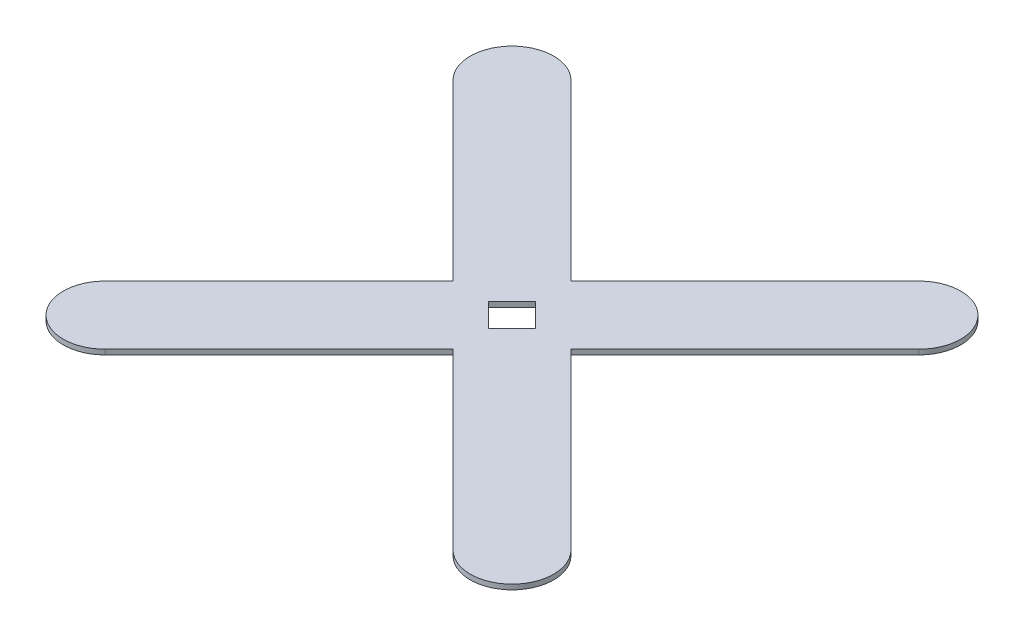
ISO-10303-21;
HEADER;
FILE_DESCRIPTION(('STEP AP214'),'2;1');
FILE_NAME('part.step','',(''),(''),'','','');
FILE_SCHEMA(('AUTOMOTIVE_DESIGN { 1 0 10303 214 1 1 1 1 }'));
ENDSEC;
DATA;
#1=APPLICATION_CONTEXT('core data for automotive mechanical design processes');
#2=APPLICATION_PROTOCOL_DEFINITION('international standard','automotive_design',2000,#1);
#3=PRODUCT_CONTEXT('',#1,'mechanical');
#4=PRODUCT('Part','Part','',(#3));
#5=PRODUCT_RELATED_PRODUCT_CATEGORY('part','',(#4));
#6=PRODUCT_DEFINITION_FORMATION('','',#4);
#7=PRODUCT_DEFINITION_CONTEXT('part definition',#1,'design');
#8=PRODUCT_DEFINITION('design','',#6,#7);
#9=PRODUCT_DEFINITION_SHAPE('','',#8);
#10=(LENGTH_UNIT() NAMED_UNIT(*) SI_UNIT(.MILLI.,.METRE.));
#11=(NAMED_UNIT(*) PLANE_ANGLE_UNIT() SI_UNIT($,.RADIAN.));
#12=(NAMED_UNIT(*) SI_UNIT($,.STERADIAN.) SOLID_ANGLE_UNIT());
#13=UNCERTAINTY_MEASURE_WITH_UNIT(LENGTH_MEASURE(1.E-05),#10,'distance_accuracy_value','');
#14=(GEOMETRIC_REPRESENTATION_CONTEXT(3) GLOBAL_UNCERTAINTY_ASSIGNED_CONTEXT((#13)) GLOBAL_UNIT_ASSIGNED_CONTEXT((#10,
#11,#12)) REPRESENTATION_CONTEXT('',''));
#15=CARTESIAN_POINT('',(0.,0.,0.));
#16=DIRECTION('',(0.,0.,1.));
#17=DIRECTION('',(1.,0.,0.));
#18=AXIS2_PLACEMENT_3D('',#15,#16,#17);
#19=CARTESIAN_POINT('',(122.,3.,122.));
#20=DIRECTION('',(0.,-1.,0.));
#21=DIRECTION('',(0.,0.,-1.));
#22=AXIS2_PLACEMENT_3D('',#19,#20,#21);
#23=CYLINDRICAL_SURFACE('',#22,25.);
#24=CARTESIAN_POINT('',(122.,0.,122.));
#25=DIRECTION('',(0.,1.,0.));
#26=DIRECTION('',(0.,0.,1.));
#27=AXIS2_PLACEMENT_3D('',#24,#25,#26);
#28=CIRCLE('',#27,25.);
#29=CARTESIAN_POINT('',(104.322330470336,0.,139.677669529664));
#30=VERTEX_POINT('',#29);
#31=CARTESIAN_POINT('',(139.677669529664,0.,104.322330470336));
#32=VERTEX_POINT('',#31);
#33=EDGE_CURVE('E171',#30,#32,#28,.T.);
#34=ORIENTED_EDGE('',*,*,#33,.T.);
#35=DIRECTION('',(0.,-1.,0.));
#36=VECTOR('',#35,1.);
#37=CARTESIAN_POINT('',(139.677669529664,3.,104.322330470336));
#38=LINE('',#37,#36);
#39=CARTESIAN_POINT('',(139.677669529664,3.,104.322330470336));
#40=VERTEX_POINT('',#39);
#41=EDGE_CURVE('E256',#40,#32,#38,.T.);
#42=ORIENTED_EDGE('',*,*,#41,.F.);
#43=CARTESIAN_POINT('',(122.,3.,122.));
#44=DIRECTION('',(0.,1.,0.));
#45=DIRECTION('',(0.,0.,1.));
#46=AXIS2_PLACEMENT_3D('',#43,#44,#45);
#47=CIRCLE('',#46,25.);
#48=CARTESIAN_POINT('',(104.322330470336,3.,139.677669529664));
#49=VERTEX_POINT('',#48);
#50=EDGE_CURVE('E174',#49,#40,#47,.T.);
#51=ORIENTED_EDGE('',*,*,#50,.F.);
#52=DIRECTION('',(0.,-1.,0.));
#53=VECTOR('',#52,1.);
#54=CARTESIAN_POINT('',(104.322330470336,3.,139.677669529664));
#55=LINE('',#54,#53);
#56=EDGE_CURVE('E200',#49,#30,#55,.T.);
#57=ORIENTED_EDGE('',*,*,#56,.T.);
#58=EDGE_LOOP('',(#34,#42,#51,#57));
#59=FACE_BOUND('',#58,.T.);
#60=ADVANCED_FACE('F33',(#59),#23,.T.);
#61=CARTESIAN_POINT('',(139.677669529664,3.,104.322330470336));
#62=DIRECTION('',(-0.707106781186548,0.,0.707106781186547));
#63=DIRECTION('',(0.707106781186547,0.,0.707106781186548));
#64=AXIS2_PLACEMENT_3D('',#61,#62,#63);
#65=PLANE('',#64);
#66=DIRECTION('',(-0.707106781186547,0.,-0.707106781186548));
#67=VECTOR('',#66,1.);
#68=CARTESIAN_POINT('',(139.677669529664,0.,104.322330470336));
#69=LINE('',#68,#67);
#70=CARTESIAN_POINT('',(35.3553390593272,0.,0.));
#71=VERTEX_POINT('',#70);
#72=EDGE_CURVE('E203',#32,#71,#69,.T.);
#73=ORIENTED_EDGE('',*,*,#72,.T.);
#74=DIRECTION('',(0.,-1.,0.));
#75=VECTOR('',#74,1.);
#76=CARTESIAN_POINT('',(35.3553390593272,3.,0.));
#77=LINE('',#76,#75);
#78=CARTESIAN_POINT('',(35.3553390593272,3.,0.));
#79=VERTEX_POINT('',#78);
#80=EDGE_CURVE('E253',#79,#71,#77,.T.);
#81=ORIENTED_EDGE('',*,*,#80,.F.);
#82=DIRECTION('',(-0.707106781186547,0.,-0.707106781186548));
#83=VECTOR('',#82,1.);
#84=CARTESIAN_POINT('',(139.677669529664,3.,104.322330470336));
#85=LINE('',#84,#83);
#86=EDGE_CURVE('E177',#40,#79,#85,.T.);
#87=ORIENTED_EDGE('',*,*,#86,.F.);
#88=ORIENTED_EDGE('',*,*,#41,.T.);
#89=EDGE_LOOP('',(#73,#81,#87,#88));
#90=FACE_BOUND('',#89,.T.);
#91=ADVANCED_FACE('F281',(#90),#65,.F.);
#92=CARTESIAN_POINT('',(35.3553390593272,3.,0.));
#93=DIRECTION('',(-0.707106781186548,0.,-0.707106781186547));
#94=DIRECTION('',(-0.707106781186547,0.,0.707106781186548));
#95=AXIS2_PLACEMENT_3D('',#92,#93,#94);
#96=PLANE('',#95);
#97=DIRECTION('',(0.707106781186547,0.,-0.707106781186548));
#98=VECTOR('',#97,1.);
#99=CARTESIAN_POINT('',(35.3553390593272,0.,0.));
#100=LINE('',#99,#98);
#101=CARTESIAN_POINT('',(139.677669529664,0.,-104.322330470336));
#102=VERTEX_POINT('',#101);
#103=EDGE_CURVE('E205',#71,#102,#100,.T.);
#104=ORIENTED_EDGE('',*,*,#103,.T.);
#105=DIRECTION('',(0.,-1.,0.));
#106=VECTOR('',#105,1.);
#107=CARTESIAN_POINT('',(139.677669529664,3.,-104.322330470336));
#108=LINE('',#107,#106);
#109=CARTESIAN_POINT('',(139.677669529664,3.,-104.322330470336));
#110=VERTEX_POINT('',#109);
#111=EDGE_CURVE('E250',#110,#102,#108,.T.);
#112=ORIENTED_EDGE('',*,*,#111,.F.);
#113=DIRECTION('',(0.707106781186547,0.,-0.707106781186548));
#114=VECTOR('',#113,1.);
#115=CARTESIAN_POINT('',(35.3553390593272,3.,0.));
#116=LINE('',#115,#114);
#117=EDGE_CURVE('E180',#79,#110,#116,.T.);
#118=ORIENTED_EDGE('',*,*,#117,.F.);
#119=ORIENTED_EDGE('',*,*,#80,.T.);
#120=EDGE_LOOP('',(#104,#112,#118,#119));
#121=FACE_BOUND('',#120,.T.);
#122=ADVANCED_FACE('F286',(#121),#96,.F.);
#123=CARTESIAN_POINT('',(122.,3.,-122.));
#124=DIRECTION('',(0.,-1.,0.));
#125=DIRECTION('',(0.,0.,-1.));
#126=AXIS2_PLACEMENT_3D('',#123,#124,#125);
#127=CYLINDRICAL_SURFACE('',#126,24.9999999999999);
#128=CARTESIAN_POINT('',(122.,0.,-122.));
#129=DIRECTION('',(0.,1.,0.));
#130=DIRECTION('',(0.,0.,1.));
#131=AXIS2_PLACEMENT_3D('',#128,#129,#130);
#132=CIRCLE('',#131,24.9999999999999);
#133=CARTESIAN_POINT('',(104.322330470336,0.,-139.677669529664));
#134=VERTEX_POINT('',#133);
#135=EDGE_CURVE('E207',#102,#134,#132,.T.);
#136=ORIENTED_EDGE('',*,*,#135,.T.);
#137=DIRECTION('',(0.,-1.,0.));
#138=VECTOR('',#137,1.);
#139=CARTESIAN_POINT('',(104.322330470336,3.,-139.677669529664));
#140=LINE('',#139,#138);
#141=CARTESIAN_POINT('',(104.322330470336,3.,-139.677669529664));
#142=VERTEX_POINT('',#141);
#143=EDGE_CURVE('E247',#142,#134,#140,.T.);
#144=ORIENTED_EDGE('',*,*,#143,.F.);
#145=CARTESIAN_POINT('',(122.,3.,-122.));
#146=DIRECTION('',(0.,1.,0.));
#147=DIRECTION('',(0.,0.,1.));
#148=AXIS2_PLACEMENT_3D('',#145,#146,#147);
#149=CIRCLE('',#148,24.9999999999999);
#150=EDGE_CURVE('E182',#110,#142,#149,.T.);
#151=ORIENTED_EDGE('',*,*,#150,.F.);
#152=ORIENTED_EDGE('',*,*,#111,.T.);
#153=EDGE_LOOP('',(#136,#144,#151,#152));
#154=FACE_BOUND('',#153,.T.);
#155=ADVANCED_FACE('F337',(#154),#127,.T.);
#156=CARTESIAN_POINT('',(0.,3.,-35.3553390593272));
#157=DIRECTION('',(0.707106781186548,0.,0.707106781186547));
#158=DIRECTION('',(0.707106781186547,0.,-0.707106781186548));
#159=AXIS2_PLACEMENT_3D('',#156,#157,#158);
#160=PLANE('',#159);
#161=DIRECTION('',(-0.707106781186547,0.,0.707106781186548));
#162=VECTOR('',#161,1.);
#163=CARTESIAN_POINT('',(0.,0.,-35.3553390593272));
#164=LINE('',#163,#162);
#165=CARTESIAN_POINT('',(0.,0.,-35.3553390593272));
#166=VERTEX_POINT('',#165);
#167=EDGE_CURVE('E209',#134,#166,#164,.T.);
#168=ORIENTED_EDGE('',*,*,#167,.T.);
#169=DIRECTION('',(0.,-1.,0.));
#170=VECTOR('',#169,1.);
#171=CARTESIAN_POINT('',(0.,3.,-35.3553390593272));
#172=LINE('',#171,#170);
#173=CARTESIAN_POINT('',(0.,3.,-35.3553390593272));
#174=VERTEX_POINT('',#173);
#175=EDGE_CURVE('E244',#174,#166,#172,.T.);
#176=ORIENTED_EDGE('',*,*,#175,.F.);
#177=DIRECTION('',(-0.707106781186547,0.,0.707106781186548));
#178=VECTOR('',#177,1.);
#179=CARTESIAN_POINT('',(0.,3.,-35.3553390593272));
#180=LINE('',#179,#178);
#181=EDGE_CURVE('E184',#142,#174,#180,.T.);
#182=ORIENTED_EDGE('',*,*,#181,.F.);
#183=ORIENTED_EDGE('',*,*,#143,.T.);
#184=EDGE_LOOP('',(#168,#176,#182,#183));
#185=FACE_BOUND('',#184,.T.);
#186=ADVANCED_FACE('F334',(#185),#160,.F.);
#187=CARTESIAN_POINT('',(0.,3.,-35.3553390593272));
#188=DIRECTION('',(-0.707106781186548,0.,0.707106781186547));
#189=DIRECTION('',(0.707106781186547,0.,0.707106781186548));
#190=AXIS2_PLACEMENT_3D('',#187,#188,#189);
#191=PLANE('',#190);
#192=DIRECTION('',(-0.707106781186547,0.,-0.707106781186548));
#193=VECTOR('',#192,1.);
#194=CARTESIAN_POINT('',(0.,0.,-35.3553390593272));
#195=LINE('',#194,#193);
#196=CARTESIAN_POINT('',(-104.322330470336,0.,-139.677669529664));
#197=VERTEX_POINT('',#196);
#198=EDGE_CURVE('E211',#166,#197,#195,.T.);
#199=ORIENTED_EDGE('',*,*,#198,.T.);
#200=DIRECTION('',(0.,-1.,0.));
#201=VECTOR('',#200,1.);
#202=CARTESIAN_POINT('',(-104.322330470336,3.,-139.677669529664));
#203=LINE('',#202,#201);
#204=CARTESIAN_POINT('',(-104.322330470336,3.,-139.677669529664));
#205=VERTEX_POINT('',#204);
#206=EDGE_CURVE('E241',#205,#197,#203,.T.);
#207=ORIENTED_EDGE('',*,*,#206,.F.);
#208=DIRECTION('',(-0.707106781186547,0.,-0.707106781186548));
#209=VECTOR('',#208,1.);
#210=CARTESIAN_POINT('',(0.,3.,-35.3553390593272));
#211=LINE('',#210,#209);
#212=EDGE_CURVE('E186',#174,#205,#211,.T.);
#213=ORIENTED_EDGE('',*,*,#212,.F.);
#214=ORIENTED_EDGE('',*,*,#175,.T.);
#215=EDGE_LOOP('',(#199,#207,#213,#214));
#216=FACE_BOUND('',#215,.T.);
#217=ADVANCED_FACE('F330',(#216),#191,.F.);
#218=CARTESIAN_POINT('',(-122.,3.,-122.));
#219=DIRECTION('',(0.,-1.,0.));
#220=DIRECTION('',(0.,0.,-1.));
#221=AXIS2_PLACEMENT_3D('',#218,#219,#220);
#222=CYLINDRICAL_SURFACE('',#221,25.);
#223=CARTESIAN_POINT('',(-122.,0.,-122.));
#224=DIRECTION('',(0.,1.,0.));
#225=DIRECTION('',(0.,0.,1.));
#226=AXIS2_PLACEMENT_3D('',#223,#224,#225);
#227=CIRCLE('',#226,25.);
#228=CARTESIAN_POINT('',(-139.677669529664,0.,-104.322330470336));
#229=VERTEX_POINT('',#228);
#230=EDGE_CURVE('E213',#197,#229,#227,.T.);
#231=ORIENTED_EDGE('',*,*,#230,.T.);
#232=DIRECTION('',(0.,-1.,0.));
#233=VECTOR('',#232,1.);
#234=CARTESIAN_POINT('',(-139.677669529664,3.,-104.322330470336));
#235=LINE('',#234,#233);
#236=CARTESIAN_POINT('',(-139.677669529664,3.,-104.322330470336));
#237=VERTEX_POINT('',#236);
#238=EDGE_CURVE('E238',#237,#229,#235,.T.);
#239=ORIENTED_EDGE('',*,*,#238,.F.);
#240=CARTESIAN_POINT('',(-122.,3.,-122.));
#241=DIRECTION('',(0.,1.,0.));
#242=DIRECTION('',(0.,0.,1.));
#243=AXIS2_PLACEMENT_3D('',#240,#241,#242);
#244=CIRCLE('',#243,25.);
#245=EDGE_CURVE('E188',#205,#237,#244,.T.);
#246=ORIENTED_EDGE('',*,*,#245,.F.);
#247=ORIENTED_EDGE('',*,*,#206,.T.);
#248=EDGE_LOOP('',(#231,#239,#246,#247));
#249=FACE_BOUND('',#248,.T.);
#250=ADVANCED_FACE('F325',(#249),#222,.T.);
#251=CARTESIAN_POINT('',(-35.3553390593274,3.,0.));
#252=DIRECTION('',(0.707106781186548,0.,-0.707106781186547));
#253=DIRECTION('',(-0.707106781186547,0.,-0.707106781186548));
#254=AXIS2_PLACEMENT_3D('',#251,#252,#253);
#255=PLANE('',#254);
#256=DIRECTION('',(0.707106781186547,0.,0.707106781186548));
#257=VECTOR('',#256,1.);
#258=CARTESIAN_POINT('',(-35.3553390593274,0.,0.));
#259=LINE('',#258,#257);
#260=CARTESIAN_POINT('',(-35.3553390593274,0.,0.));
#261=VERTEX_POINT('',#260);
#262=EDGE_CURVE('E215',#229,#261,#259,.T.);
#263=ORIENTED_EDGE('',*,*,#262,.T.);
#264=DIRECTION('',(0.,-1.,0.));
#265=VECTOR('',#264,1.);
#266=CARTESIAN_POINT('',(-35.3553390593274,3.,0.));
#267=LINE('',#266,#265);
#268=CARTESIAN_POINT('',(-35.3553390593274,3.,0.));
#269=VERTEX_POINT('',#268);
#270=EDGE_CURVE('E235',#269,#261,#267,.T.);
#271=ORIENTED_EDGE('',*,*,#270,.F.);
#272=DIRECTION('',(0.707106781186547,0.,0.707106781186548));
#273=VECTOR('',#272,1.);
#274=CARTESIAN_POINT('',(-35.3553390593274,3.,0.));
#275=LINE('',#274,#273);
#276=EDGE_CURVE('E190',#237,#269,#275,.T.);
#277=ORIENTED_EDGE('',*,*,#276,.F.);
#278=ORIENTED_EDGE('',*,*,#238,.T.);
#279=EDGE_LOOP('',(#263,#271,#277,#278));
#280=FACE_BOUND('',#279,.T.);
#281=ADVANCED_FACE('F319',(#280),#255,.F.);
#282=CARTESIAN_POINT('',(-139.677669529664,3.,104.322330470337));
#283=DIRECTION('',(0.707106781186548,0.,0.707106781186547));
#284=DIRECTION('',(0.707106781186547,0.,-0.707106781186548));
#285=AXIS2_PLACEMENT_3D('',#282,#283,#284);
#286=PLANE('',#285);
#287=DIRECTION('',(-0.707106781186547,0.,0.707106781186548));
#288=VECTOR('',#287,1.);
#289=CARTESIAN_POINT('',(-139.677669529664,0.,104.322330470337));
#290=LINE('',#289,#288);
#291=CARTESIAN_POINT('',(-139.677669529664,0.,104.322330470337));
#292=VERTEX_POINT('',#291);
#293=EDGE_CURVE('E217',#261,#292,#290,.T.);
#294=ORIENTED_EDGE('',*,*,#293,.T.);
#295=DIRECTION('',(0.,-1.,0.));
#296=VECTOR('',#295,1.);
#297=CARTESIAN_POINT('',(-139.677669529664,3.,104.322330470337));
#298=LINE('',#297,#296);
#299=CARTESIAN_POINT('',(-139.677669529664,3.,104.322330470337));
#300=VERTEX_POINT('',#299);
#301=EDGE_CURVE('E232',#300,#292,#298,.T.);
#302=ORIENTED_EDGE('',*,*,#301,.F.);
#303=DIRECTION('',(-0.707106781186547,0.,0.707106781186548));
#304=VECTOR('',#303,1.);
#305=CARTESIAN_POINT('',(-139.677669529664,3.,104.322330470337));
#306=LINE('',#305,#304);
#307=EDGE_CURVE('E192',#269,#300,#306,.T.);
#308=ORIENTED_EDGE('',*,*,#307,.F.);
#309=ORIENTED_EDGE('',*,*,#270,.T.);
#310=EDGE_LOOP('',(#294,#302,#308,#309));
#311=FACE_BOUND('',#310,.T.);
#312=ADVANCED_FACE('F315',(#311),#286,.F.);
#313=CARTESIAN_POINT('',(-122.,3.,122.));
#314=DIRECTION('',(0.,-1.,0.));
#315=DIRECTION('',(0.,0.,-1.));
#316=AXIS2_PLACEMENT_3D('',#313,#314,#315);
#317=CYLINDRICAL_SURFACE('',#316,24.9999999999999);
#318=CARTESIAN_POINT('',(-122.,0.,122.));
#319=DIRECTION('',(0.,1.,0.));
#320=DIRECTION('',(0.,0.,1.));
#321=AXIS2_PLACEMENT_3D('',#318,#319,#320);
#322=CIRCLE('',#321,24.9999999999999);
#323=CARTESIAN_POINT('',(-104.322330470337,0.,139.677669529664));
#324=VERTEX_POINT('',#323);
#325=EDGE_CURVE('E219',#292,#324,#322,.T.);
#326=ORIENTED_EDGE('',*,*,#325,.T.);
#327=DIRECTION('',(0.,-1.,0.));
#328=VECTOR('',#327,1.);
#329=CARTESIAN_POINT('',(-104.322330470337,3.,139.677669529664));
#330=LINE('',#329,#328);
#331=CARTESIAN_POINT('',(-104.322330470337,3.,139.677669529664));
#332=VERTEX_POINT('',#331);
#333=EDGE_CURVE('E229',#332,#324,#330,.T.);
#334=ORIENTED_EDGE('',*,*,#333,.F.);
#335=CARTESIAN_POINT('',(-122.,3.,122.));
#336=DIRECTION('',(0.,1.,0.));
#337=DIRECTION('',(0.,0.,1.));
#338=AXIS2_PLACEMENT_3D('',#335,#336,#337);
#339=CIRCLE('',#338,24.9999999999999);
#340=EDGE_CURVE('E194',#300,#332,#339,.T.);
#341=ORIENTED_EDGE('',*,*,#340,.F.);
#342=ORIENTED_EDGE('',*,*,#301,.T.);
#343=EDGE_LOOP('',(#326,#334,#341,#342));
#344=FACE_BOUND('',#343,.T.);
#345=ADVANCED_FACE('F310',(#344),#317,.T.);
#346=CARTESIAN_POINT('',(-104.322330470337,3.,139.677669529664));
#347=DIRECTION('',(-0.707106781186547,0.,-0.707106781186548));
#348=DIRECTION('',(-0.707106781186548,0.,0.707106781186547));
#349=AXIS2_PLACEMENT_3D('',#346,#347,#348);
#350=PLANE('',#349);
#351=DIRECTION('',(0.707106781186548,0.,-0.707106781186547));
#352=VECTOR('',#351,1.);
#353=CARTESIAN_POINT('',(-104.322330470337,0.,139.677669529664));
#354=LINE('',#353,#352);
#355=CARTESIAN_POINT('',(-1.52655665885959E-13,0.,35.3553390593274));
#356=VERTEX_POINT('',#355);
#357=EDGE_CURVE('E221',#324,#356,#354,.T.);
#358=ORIENTED_EDGE('',*,*,#357,.T.);
#359=DIRECTION('',(0.,-1.,0.));
#360=VECTOR('',#359,1.);
#361=CARTESIAN_POINT('',(-1.52655665885959E-13,3.,35.3553390593274));
#362=LINE('',#361,#360);
#363=CARTESIAN_POINT('',(-1.52655665885959E-13,3.,35.3553390593274));
#364=VERTEX_POINT('',#363);
#365=EDGE_CURVE('E226',#364,#356,#362,.T.);
#366=ORIENTED_EDGE('',*,*,#365,.F.);
#367=DIRECTION('',(0.707106781186548,0.,-0.707106781186547));
#368=VECTOR('',#367,1.);
#369=CARTESIAN_POINT('',(-104.322330470337,3.,139.677669529664));
#370=LINE('',#369,#368);
#371=EDGE_CURVE('E196',#332,#364,#370,.T.);
#372=ORIENTED_EDGE('',*,*,#371,.F.);
#373=ORIENTED_EDGE('',*,*,#333,.T.);
#374=EDGE_LOOP('',(#358,#366,#372,#373));
#375=FACE_BOUND('',#374,.T.);
#376=ADVANCED_FACE('F304',(#375),#350,.F.);
#377=CARTESIAN_POINT('',(104.322330470336,3.,139.677669529664));
#378=DIRECTION('',(0.707106781186547,0.,-0.707106781186548));
#379=DIRECTION('',(-0.707106781186548,0.,-0.707106781186547));
#380=AXIS2_PLACEMENT_3D('',#377,#378,#379);
#381=PLANE('',#380);
#382=DIRECTION('',(0.707106781186548,0.,0.707106781186547));
#383=VECTOR('',#382,1.);
#384=CARTESIAN_POINT('',(104.322330470336,0.,139.677669529664));
#385=LINE('',#384,#383);
#386=EDGE_CURVE('E178',#356,#30,#385,.T.);
#387=ORIENTED_EDGE('',*,*,#386,.T.);
#388=ORIENTED_EDGE('',*,*,#56,.F.);
#389=DIRECTION('',(0.707106781186548,0.,0.707106781186547));
#390=VECTOR('',#389,1.);
#391=CARTESIAN_POINT('',(104.322330470336,3.,139.677669529664));
#392=LINE('',#391,#390);
#393=EDGE_CURVE('E198',#364,#49,#392,.T.);
#394=ORIENTED_EDGE('',*,*,#393,.F.);
#395=ORIENTED_EDGE('',*,*,#365,.T.);
#396=EDGE_LOOP('',(#387,#388,#394,#395));
#397=FACE_BOUND('',#396,.T.);
#398=ADVANCED_FACE('F302',(#397),#381,.F.);
#399=CARTESIAN_POINT('',(122.,3.,122.));
#400=DIRECTION('',(0.,1.,0.));
#401=DIRECTION('',(0.,0.,1.));
#402=AXIS2_PLACEMENT_3D('',#399,#400,#401);
#403=PLANE('',#402);
#404=DIRECTION('',(-0.707106781186549,0.,-0.707106781186546));
#405=VECTOR('',#404,1.);
#406=CARTESIAN_POINT('',(14.142135623731,3.,0.));
#407=LINE('',#406,#405);
#408=CARTESIAN_POINT('',(14.142135623731,3.,0.));
#409=VERTEX_POINT('',#408);
#410=CARTESIAN_POINT('',(0.,3.,-14.1421356237309));
#411=VERTEX_POINT('',#410);
#412=EDGE_CURVE('E47',#409,#411,#407,.T.);
#413=ORIENTED_EDGE('',*,*,#412,.F.);
#414=DIRECTION('',(0.707106781186546,0.,-0.707106781186549));
#415=VECTOR('',#414,1.);
#416=CARTESIAN_POINT('',(0.,3.,14.142135623731));
#417=LINE('',#416,#415);
#418=CARTESIAN_POINT('',(0.,3.,14.142135623731));
#419=VERTEX_POINT('',#418);
#420=EDGE_CURVE('E164',#419,#409,#417,.T.);
#421=ORIENTED_EDGE('',*,*,#420,.F.);
#422=DIRECTION('',(0.707106781186549,0.,0.707106781186546));
#423=VECTOR('',#422,1.);
#424=CARTESIAN_POINT('',(0.,3.,14.142135623731));
#425=LINE('',#424,#423);
#426=CARTESIAN_POINT('',(-14.142135623731,3.,0.));
#427=VERTEX_POINT('',#426);
#428=EDGE_CURVE('E148',#427,#419,#425,.T.);
#429=ORIENTED_EDGE('',*,*,#428,.F.);
#430=DIRECTION('',(-0.707106781186546,0.,0.707106781186549));
#431=VECTOR('',#430,1.);
#432=CARTESIAN_POINT('',(-14.142135623731,3.,0.));
#433=LINE('',#432,#431);
#434=EDGE_CURVE('E157',#411,#427,#433,.T.);
#435=ORIENTED_EDGE('',*,*,#434,.F.);
#436=EDGE_LOOP('',(#413,#421,#429,#435));
#437=FACE_BOUND('',#436,.T.);
#438=ORIENTED_EDGE('',*,*,#50,.T.);
#439=ORIENTED_EDGE('',*,*,#86,.T.);
#440=ORIENTED_EDGE('',*,*,#117,.T.);
#441=ORIENTED_EDGE('',*,*,#150,.T.);
#442=ORIENTED_EDGE('',*,*,#181,.T.);
#443=ORIENTED_EDGE('',*,*,#212,.T.);
#444=ORIENTED_EDGE('',*,*,#245,.T.);
#445=ORIENTED_EDGE('',*,*,#276,.T.);
#446=ORIENTED_EDGE('',*,*,#307,.T.);
#447=ORIENTED_EDGE('',*,*,#340,.T.);
#448=ORIENTED_EDGE('',*,*,#371,.T.);
#449=ORIENTED_EDGE('',*,*,#393,.T.);
#450=EDGE_LOOP('',(#438,#439,#440,#441,#442,#443,#444,#445,#446,#447,#448,#449));
#451=FACE_BOUND('',#450,.T.);
#452=ADVANCED_FACE('F161',(#437,#451),#403,.T.);
#453=CARTESIAN_POINT('',(122.,0.,122.));
#454=DIRECTION('',(0.,1.,0.));
#455=DIRECTION('',(0.,0.,1.));
#456=AXIS2_PLACEMENT_3D('',#453,#454,#455);
#457=PLANE('',#456);
#458=DIRECTION('',(0.707106781186546,0.,-0.707106781186549));
#459=VECTOR('',#458,1.);
#460=CARTESIAN_POINT('',(7.0710678118652,0.,7.07106781186571));
#461=LINE('',#460,#459);
#462=CARTESIAN_POINT('',(0.,0.,14.142135623731));
#463=VERTEX_POINT('',#462);
#464=CARTESIAN_POINT('',(14.142135623731,0.,0.));
#465=VERTEX_POINT('',#464);
#466=EDGE_CURVE('E40',#463,#465,#461,.T.);
#467=ORIENTED_EDGE('',*,*,#466,.T.);
#468=DIRECTION('',(-0.707106781186549,0.,-0.707106781186546));
#469=VECTOR('',#468,1.);
#470=CARTESIAN_POINT('',(129.071067811866,0.,114.928932188134));
#471=LINE('',#470,#469);
#472=CARTESIAN_POINT('',(0.,0.,-14.142135623731));
#473=VERTEX_POINT('',#472);
#474=EDGE_CURVE('E11',#465,#473,#471,.T.);
#475=ORIENTED_EDGE('',*,*,#474,.T.);
#476=DIRECTION('',(-0.707106781186546,0.,0.707106781186549));
#477=VECTOR('',#476,1.);
#478=CARTESIAN_POINT('',(-7.07106781186577,0.,-7.07106781186517));
#479=LINE('',#478,#477);
#480=CARTESIAN_POINT('',(-14.1421356237309,0.,0.));
#481=VERTEX_POINT('',#480);
#482=EDGE_CURVE('E259',#473,#481,#479,.T.);
#483=ORIENTED_EDGE('',*,*,#482,.T.);
#484=DIRECTION('',(0.707106781186549,0.,0.707106781186546));
#485=VECTOR('',#484,1.);
#486=CARTESIAN_POINT('',(114.928932188135,0.,129.071067811865));
#487=LINE('',#486,#485);
#488=EDGE_CURVE('E151',#481,#463,#487,.T.);
#489=ORIENTED_EDGE('',*,*,#488,.T.);
#490=EDGE_LOOP('',(#467,#475,#483,#489));
#491=FACE_BOUND('',#490,.T.);
#492=ORIENTED_EDGE('',*,*,#33,.F.);
#493=ORIENTED_EDGE('',*,*,#386,.F.);
#494=ORIENTED_EDGE('',*,*,#357,.F.);
#495=ORIENTED_EDGE('',*,*,#325,.F.);
#496=ORIENTED_EDGE('',*,*,#293,.F.);
#497=ORIENTED_EDGE('',*,*,#262,.F.);
#498=ORIENTED_EDGE('',*,*,#230,.F.);
#499=ORIENTED_EDGE('',*,*,#198,.F.);
#500=ORIENTED_EDGE('',*,*,#167,.F.);
#501=ORIENTED_EDGE('',*,*,#135,.F.);
#502=ORIENTED_EDGE('',*,*,#103,.F.);
#503=ORIENTED_EDGE('',*,*,#72,.F.);
#504=EDGE_LOOP('',(#492,#493,#494,#495,#496,#497,#498,#499,#500,#501,#502,#503));
#505=FACE_BOUND('',#504,.T.);
#506=ADVANCED_FACE('F263',(#491,#505),#457,.F.);
#507=CARTESIAN_POINT('',(14.142135623731,-2.,0.));
#508=DIRECTION('',(0.707106781186546,0.,-0.707106781186549));
#509=DIRECTION('',(-0.707106781186549,0.,-0.707106781186546));
#510=AXIS2_PLACEMENT_3D('',#507,#508,#509);
#511=PLANE('',#510);
#512=DIRECTION('',(0.,1.,0.));
#513=VECTOR('',#512,1.);
#514=CARTESIAN_POINT('',(14.142135623731,-2.,0.));
#515=LINE('',#514,#513);
#516=EDGE_CURVE('E169',#465,#409,#515,.T.);
#517=ORIENTED_EDGE('',*,*,#516,.T.);
#518=ORIENTED_EDGE('',*,*,#412,.T.);
#519=DIRECTION('',(0.,1.,0.));
#520=VECTOR('',#519,1.);
#521=CARTESIAN_POINT('',(0.,-2.,-14.142135623731));
#522=LINE('',#521,#520);
#523=EDGE_CURVE('E154',#473,#411,#522,.T.);
#524=ORIENTED_EDGE('',*,*,#523,.F.);
#525=ORIENTED_EDGE('',*,*,#474,.F.);
#526=EDGE_LOOP('',(#517,#518,#524,#525));
#527=FACE_BOUND('',#526,.T.);
#528=ADVANCED_FACE('F268',(#527),#511,.F.);
#529=CARTESIAN_POINT('',(0.,-2.,14.142135623731));
#530=DIRECTION('',(0.707106781186549,0.,0.707106781186546));
#531=DIRECTION('',(0.707106781186546,0.,-0.707106781186549));
#532=AXIS2_PLACEMENT_3D('',#529,#530,#531);
#533=PLANE('',#532);
#534=DIRECTION('',(0.,1.,0.));
#535=VECTOR('',#534,1.);
#536=CARTESIAN_POINT('',(0.,-2.,14.142135623731));
#537=LINE('',#536,#535);
#538=EDGE_CURVE('E153',#463,#419,#537,.T.);
#539=ORIENTED_EDGE('',*,*,#538,.T.);
#540=ORIENTED_EDGE('',*,*,#420,.T.);
#541=ORIENTED_EDGE('',*,*,#516,.F.);
#542=ORIENTED_EDGE('',*,*,#466,.F.);
#543=EDGE_LOOP('',(#539,#540,#541,#542));
#544=FACE_BOUND('',#543,.T.);
#545=ADVANCED_FACE('F267',(#544),#533,.F.);
#546=CARTESIAN_POINT('',(0.,-2.,14.142135623731));
#547=DIRECTION('',(-0.707106781186546,0.,0.707106781186549));
#548=DIRECTION('',(0.707106781186549,0.,0.707106781186546));
#549=AXIS2_PLACEMENT_3D('',#546,#547,#548);
#550=PLANE('',#549);
#551=DIRECTION('',(0.,1.,0.));
#552=VECTOR('',#551,1.);
#553=CARTESIAN_POINT('',(-14.142135623731,-2.,0.));
#554=LINE('',#553,#552);
#555=EDGE_CURVE('E55',#481,#427,#554,.T.);
#556=ORIENTED_EDGE('',*,*,#555,.T.);
#557=ORIENTED_EDGE('',*,*,#428,.T.);
#558=ORIENTED_EDGE('',*,*,#538,.F.);
#559=ORIENTED_EDGE('',*,*,#488,.F.);
#560=EDGE_LOOP('',(#556,#557,#558,#559));
#561=FACE_BOUND('',#560,.T.);
#562=ADVANCED_FACE('F145',(#561),#550,.F.);
#563=CARTESIAN_POINT('',(-14.142135623731,-2.,0.));
#564=DIRECTION('',(-0.707106781186549,0.,-0.707106781186546));
#565=DIRECTION('',(-0.707106781186546,0.,0.707106781186549));
#566=AXIS2_PLACEMENT_3D('',#563,#564,#565);
#567=PLANE('',#566);
#568=ORIENTED_EDGE('',*,*,#523,.T.);
#569=ORIENTED_EDGE('',*,*,#434,.T.);
#570=ORIENTED_EDGE('',*,*,#555,.F.);
#571=ORIENTED_EDGE('',*,*,#482,.F.);
#572=EDGE_LOOP('',(#568,#569,#570,#571));
#573=FACE_BOUND('',#572,.T.);
#574=ADVANCED_FACE('F158',(#573),#567,.F.);
#575=CLOSED_SHELL('',(#60,#91,#122,#155,#186,#217,#250,#281,#312,#345,#376,#398,#452,#506,#528,
#545,#562,#574));
#576=MANIFOLD_SOLID_BREP('B2',#575);
#577=ADVANCED_BREP_SHAPE_REPRESENTATION('',(#18,#576),#14);
#578=SHAPE_DEFINITION_REPRESENTATION(#9,#577);
ENDSEC;
END-ISO-10303-21;
